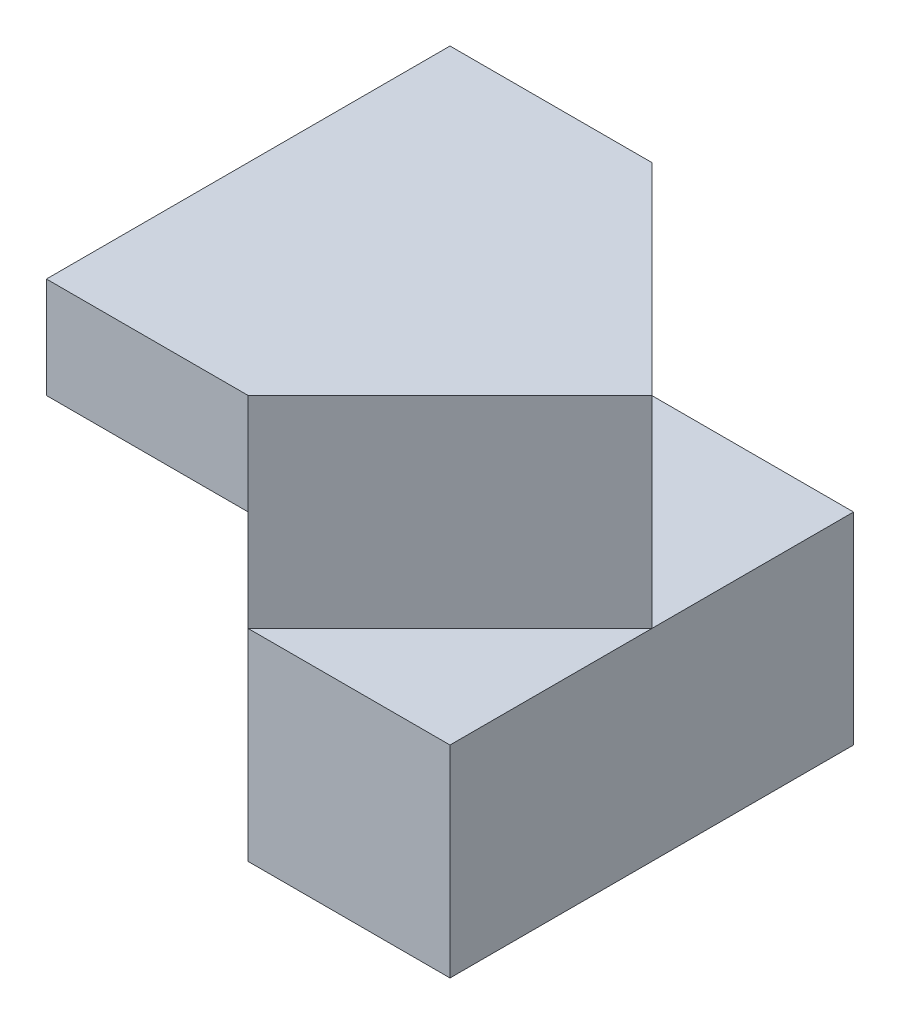
ISO-10303-21;
HEADER;
FILE_DESCRIPTION(('STEP AP214'),'2;1');
FILE_NAME('part.step','',(''),(''),'','','');
FILE_SCHEMA(('AUTOMOTIVE_DESIGN { 1 0 10303 214 1 1 1 1 }'));
ENDSEC;
DATA;
#1=APPLICATION_CONTEXT('core data for automotive mechanical design processes');
#2=APPLICATION_PROTOCOL_DEFINITION('international standard','automotive_design',2000,#1);
#3=PRODUCT_CONTEXT('',#1,'mechanical');
#4=PRODUCT('Part','Part','',(#3));
#5=PRODUCT_RELATED_PRODUCT_CATEGORY('part','',(#4));
#6=PRODUCT_DEFINITION_FORMATION('','',#4);
#7=PRODUCT_DEFINITION_CONTEXT('part definition',#1,'design');
#8=PRODUCT_DEFINITION('design','',#6,#7);
#9=PRODUCT_DEFINITION_SHAPE('','',#8);
#10=(LENGTH_UNIT() NAMED_UNIT(*) SI_UNIT(.MILLI.,.METRE.));
#11=(NAMED_UNIT(*) PLANE_ANGLE_UNIT() SI_UNIT($,.RADIAN.));
#12=(NAMED_UNIT(*) SI_UNIT($,.STERADIAN.) SOLID_ANGLE_UNIT());
#13=UNCERTAINTY_MEASURE_WITH_UNIT(LENGTH_MEASURE(1.E-05),#10,'distance_accuracy_value','');
#14=(GEOMETRIC_REPRESENTATION_CONTEXT(3) GLOBAL_UNCERTAINTY_ASSIGNED_CONTEXT((#13)) GLOBAL_UNIT_ASSIGNED_CONTEXT((#10,
#11,#12)) REPRESENTATION_CONTEXT('',''));
#15=CARTESIAN_POINT('',(0.,0.,0.));
#16=DIRECTION('',(0.,0.,1.));
#17=DIRECTION('',(1.,0.,0.));
#18=AXIS2_PLACEMENT_3D('',#15,#16,#17);
#19=CARTESIAN_POINT('',(0.,0.,0.));
#20=DIRECTION('',(0.,-1.,0.));
#21=DIRECTION('',(0.,0.,-1.));
#22=AXIS2_PLACEMENT_3D('',#19,#20,#21);
#23=PLANE('',#22);
#24=DIRECTION('',(0.,0.,1.));
#25=VECTOR('',#24,1.);
#26=CARTESIAN_POINT('',(2.,0.,-2.));
#27=LINE('',#26,#25);
#28=CARTESIAN_POINT('',(2.,0.,-4.));
#29=VERTEX_POINT('',#28);
#30=CARTESIAN_POINT('',(2.,0.,0.));
#31=VERTEX_POINT('',#30);
#32=EDGE_CURVE('E71',#29,#31,#27,.T.);
#33=ORIENTED_EDGE('',*,*,#32,.F.);
#34=DIRECTION('',(-1.,0.,0.));
#35=VECTOR('',#34,1.);
#36=CARTESIAN_POINT('',(0.,0.,-4.));
#37=LINE('',#36,#35);
#38=CARTESIAN_POINT('',(4.,0.,-4.));
#39=VERTEX_POINT('',#38);
#40=EDGE_CURVE('E125',#39,#29,#37,.T.);
#41=ORIENTED_EDGE('',*,*,#40,.F.);
#42=DIRECTION('',(0.,0.,-1.));
#43=VECTOR('',#42,1.);
#44=CARTESIAN_POINT('',(4.,0.,0.));
#45=LINE('',#44,#43);
#46=CARTESIAN_POINT('',(4.,0.,0.));
#47=VERTEX_POINT('',#46);
#48=EDGE_CURVE('E131',#47,#39,#45,.T.);
#49=ORIENTED_EDGE('',*,*,#48,.F.);
#50=DIRECTION('',(1.,0.,0.));
#51=VECTOR('',#50,1.);
#52=CARTESIAN_POINT('',(0.,0.,0.));
#53=LINE('',#52,#51);
#54=EDGE_CURVE('E129',#31,#47,#53,.T.);
#55=ORIENTED_EDGE('',*,*,#54,.F.);
#56=EDGE_LOOP('',(#33,#41,#49,#55));
#57=FACE_BOUND('',#56,.T.);
#58=ADVANCED_FACE('F33',(#57),#23,.T.);
#59=CARTESIAN_POINT('',(0.,4.,0.));
#60=DIRECTION('',(0.,0.,-1.));
#61=DIRECTION('',(-1.,0.,0.));
#62=AXIS2_PLACEMENT_3D('',#59,#60,#61);
#63=PLANE('',#62);
#64=DIRECTION('',(1.,0.,0.));
#65=VECTOR('',#64,1.);
#66=CARTESIAN_POINT('',(4.,2.,0.));
#67=LINE('',#66,#65);
#68=CARTESIAN_POINT('',(2.,2.,0.));
#69=VERTEX_POINT('',#68);
#70=CARTESIAN_POINT('',(4.,2.,0.));
#71=VERTEX_POINT('',#70);
#72=EDGE_CURVE('E111',#69,#71,#67,.T.);
#73=ORIENTED_EDGE('',*,*,#72,.F.);
#74=DIRECTION('',(0.,1.,0.));
#75=VECTOR('',#74,1.);
#76=CARTESIAN_POINT('',(2.,0.,0.));
#77=LINE('',#76,#75);
#78=EDGE_CURVE('E196',#31,#69,#77,.T.);
#79=ORIENTED_EDGE('',*,*,#78,.F.);
#80=ORIENTED_EDGE('',*,*,#54,.T.);
#81=DIRECTION('',(0.,-1.,0.));
#82=VECTOR('',#81,1.);
#83=CARTESIAN_POINT('',(4.,4.,0.));
#84=LINE('',#83,#82);
#85=EDGE_CURVE('E42',#71,#47,#84,.T.);
#86=ORIENTED_EDGE('',*,*,#85,.F.);
#87=EDGE_LOOP('',(#73,#79,#80,#86));
#88=FACE_BOUND('',#87,.T.);
#89=ADVANCED_FACE('F213',(#88),#63,.F.);
#90=CARTESIAN_POINT('',(0.,4.,0.));
#91=DIRECTION('',(1.,0.,0.));
#92=DIRECTION('',(0.,0.,-1.));
#93=AXIS2_PLACEMENT_3D('',#90,#91,#92);
#94=PLANE('',#93);
#95=DIRECTION('',(0.,-1.,0.));
#96=VECTOR('',#95,1.);
#97=CARTESIAN_POINT('',(0.,4.,-4.));
#98=LINE('',#97,#96);
#99=CARTESIAN_POINT('',(0.,4.,-4.));
#100=VERTEX_POINT('',#99);
#101=CARTESIAN_POINT('',(0.,0.,-4.));
#102=VERTEX_POINT('',#101);
#103=EDGE_CURVE('E123',#100,#102,#98,.T.);
#104=ORIENTED_EDGE('',*,*,#103,.T.);
#105=DIRECTION('',(0.,-0.832050294337844,-0.554700196225229));
#106=VECTOR('',#105,1.);
#107=CARTESIAN_POINT('',(0.,1.84615384615385,-2.76923076923077));
#108=LINE('',#107,#106);
#109=CARTESIAN_POINT('',(0.,3.,-2.));
#110=VERTEX_POINT('',#109);
#111=EDGE_CURVE('E170',#110,#102,#108,.T.);
#112=ORIENTED_EDGE('',*,*,#111,.F.);
#113=DIRECTION('',(0.,0.,-1.));
#114=VECTOR('',#113,1.);
#115=CARTESIAN_POINT('',(0.,3.,0.));
#116=LINE('',#115,#114);
#117=CARTESIAN_POINT('',(0.,3.,0.));
#118=VERTEX_POINT('',#117);
#119=EDGE_CURVE('E194',#118,#110,#116,.T.);
#120=ORIENTED_EDGE('',*,*,#119,.F.);
#121=DIRECTION('',(0.,-1.,0.));
#122=VECTOR('',#121,1.);
#123=CARTESIAN_POINT('',(0.,4.,0.));
#124=LINE('',#123,#122);
#125=CARTESIAN_POINT('',(0.,4.,0.));
#126=VERTEX_POINT('',#125);
#127=EDGE_CURVE('E11',#126,#118,#124,.T.);
#128=ORIENTED_EDGE('',*,*,#127,.F.);
#129=DIRECTION('',(0.,0.,1.));
#130=VECTOR('',#129,1.);
#131=CARTESIAN_POINT('',(0.,4.,0.));
#132=LINE('',#131,#130);
#133=EDGE_CURVE('E120',#100,#126,#132,.T.);
#134=ORIENTED_EDGE('',*,*,#133,.F.);
#135=EDGE_LOOP('',(#104,#112,#120,#128,#134));
#136=FACE_BOUND('',#135,.T.);
#137=ADVANCED_FACE('F35',(#136),#94,.F.);
#138=DIRECTION('',(-1.,0.,0.));
#139=VECTOR('',#138,1.);
#140=CARTESIAN_POINT('',(2.,3.,0.));
#141=LINE('',#140,#139);
#142=CARTESIAN_POINT('',(2.,3.,0.));
#143=VERTEX_POINT('',#142);
#144=EDGE_CURVE('E83',#143,#118,#141,.T.);
#145=ORIENTED_EDGE('',*,*,#144,.F.);
#146=DIRECTION('',(0.,1.,0.));
#147=VECTOR('',#146,1.);
#148=CARTESIAN_POINT('',(2.,2.,0.));
#149=LINE('',#148,#147);
#150=CARTESIAN_POINT('',(2.,4.,0.));
#151=VERTEX_POINT('',#150);
#152=EDGE_CURVE('E107',#143,#151,#149,.T.);
#153=ORIENTED_EDGE('',*,*,#152,.T.);
#154=DIRECTION('',(1.,0.,0.));
#155=VECTOR('',#154,1.);
#156=CARTESIAN_POINT('',(0.,4.,0.));
#157=LINE('',#156,#155);
#158=EDGE_CURVE('E116',#126,#151,#157,.T.);
#159=ORIENTED_EDGE('',*,*,#158,.F.);
#160=ORIENTED_EDGE('',*,*,#127,.T.);
#161=EDGE_LOOP('',(#145,#153,#159,#160));
#162=FACE_BOUND('',#161,.T.);
#163=ADVANCED_FACE('F115',(#162),#63,.F.);
#164=CARTESIAN_POINT('',(4.,4.,0.));
#165=DIRECTION('',(-1.,0.,0.));
#166=DIRECTION('',(0.,0.,1.));
#167=AXIS2_PLACEMENT_3D('',#164,#165,#166);
#168=PLANE('',#167);
#169=DIRECTION('',(0.,-1.,0.));
#170=VECTOR('',#169,1.);
#171=CARTESIAN_POINT('',(4.,4.,-4.));
#172=LINE('',#171,#170);
#173=CARTESIAN_POINT('',(4.,2.,-4.));
#174=VERTEX_POINT('',#173);
#175=EDGE_CURVE('E138',#174,#39,#172,.T.);
#176=ORIENTED_EDGE('',*,*,#175,.F.);
#177=DIRECTION('',(0.,0.,-1.));
#178=VECTOR('',#177,1.);
#179=CARTESIAN_POINT('',(4.,2.,-2.));
#180=LINE('',#179,#178);
#181=CARTESIAN_POINT('',(4.,2.,-2.));
#182=VERTEX_POINT('',#181);
#183=EDGE_CURVE('E182',#182,#174,#180,.T.);
#184=ORIENTED_EDGE('',*,*,#183,.F.);
#185=DIRECTION('',(0.,0.,-1.));
#186=VECTOR('',#185,1.);
#187=CARTESIAN_POINT('',(4.,2.,-2.));
#188=LINE('',#187,#186);
#189=EDGE_CURVE('E189',#71,#182,#188,.T.);
#190=ORIENTED_EDGE('',*,*,#189,.F.);
#191=ORIENTED_EDGE('',*,*,#85,.T.);
#192=ORIENTED_EDGE('',*,*,#48,.T.);
#193=EDGE_LOOP('',(#176,#184,#190,#191,#192));
#194=FACE_BOUND('',#193,.T.);
#195=ADVANCED_FACE('F151',(#194),#168,.F.);
#196=CARTESIAN_POINT('',(0.,4.,-4.));
#197=DIRECTION('',(0.,0.,1.));
#198=DIRECTION('',(1.,0.,0.));
#199=AXIS2_PLACEMENT_3D('',#196,#197,#198);
#200=PLANE('',#199);
#201=DIRECTION('',(-1.,0.,0.));
#202=VECTOR('',#201,1.);
#203=CARTESIAN_POINT('',(0.,4.,-4.));
#204=LINE('',#203,#202);
#205=CARTESIAN_POINT('',(2.,4.,-4.));
#206=VERTEX_POINT('',#205);
#207=EDGE_CURVE('E50',#206,#100,#204,.T.);
#208=ORIENTED_EDGE('',*,*,#207,.F.);
#209=DIRECTION('',(0.,1.,0.));
#210=VECTOR('',#209,1.);
#211=CARTESIAN_POINT('',(2.,2.,-4.));
#212=LINE('',#211,#210);
#213=CARTESIAN_POINT('',(2.,2.,-4.));
#214=VERTEX_POINT('',#213);
#215=EDGE_CURVE('E112',#214,#206,#212,.T.);
#216=ORIENTED_EDGE('',*,*,#215,.F.);
#217=DIRECTION('',(-1.,0.,0.));
#218=VECTOR('',#217,1.);
#219=CARTESIAN_POINT('',(4.,2.,-4.));
#220=LINE('',#219,#218);
#221=EDGE_CURVE('E148',#174,#214,#220,.T.);
#222=ORIENTED_EDGE('',*,*,#221,.F.);
#223=ORIENTED_EDGE('',*,*,#175,.T.);
#224=ORIENTED_EDGE('',*,*,#40,.T.);
#225=DIRECTION('',(-1.,0.,0.));
#226=VECTOR('',#225,1.);
#227=CARTESIAN_POINT('',(2.,0.,-4.));
#228=LINE('',#227,#226);
#229=EDGE_CURVE('E163',#29,#102,#228,.T.);
#230=ORIENTED_EDGE('',*,*,#229,.T.);
#231=ORIENTED_EDGE('',*,*,#103,.F.);
#232=EDGE_LOOP('',(#208,#216,#222,#223,#224,#230,#231));
#233=FACE_BOUND('',#232,.T.);
#234=ADVANCED_FACE('F142',(#233),#200,.F.);
#235=CARTESIAN_POINT('',(0.,4.,0.));
#236=DIRECTION('',(0.,-1.,0.));
#237=DIRECTION('',(0.,0.,-1.));
#238=AXIS2_PLACEMENT_3D('',#235,#236,#237);
#239=PLANE('',#238);
#240=DIRECTION('',(-0.707106781186548,0.,0.707106781186548));
#241=VECTOR('',#240,1.);
#242=CARTESIAN_POINT('',(2.,4.,0.));
#243=LINE('',#242,#241);
#244=CARTESIAN_POINT('',(4.,4.,-2.));
#245=VERTEX_POINT('',#244);
#246=EDGE_CURVE('E104',#245,#151,#243,.T.);
#247=ORIENTED_EDGE('',*,*,#246,.F.);
#248=DIRECTION('',(0.707106781186548,0.,0.707106781186548));
#249=VECTOR('',#248,1.);
#250=CARTESIAN_POINT('',(2.,4.,-4.));
#251=LINE('',#250,#249);
#252=EDGE_CURVE('E171',#206,#245,#251,.T.);
#253=ORIENTED_EDGE('',*,*,#252,.F.);
#254=ORIENTED_EDGE('',*,*,#207,.T.);
#255=ORIENTED_EDGE('',*,*,#133,.T.);
#256=ORIENTED_EDGE('',*,*,#158,.T.);
#257=EDGE_LOOP('',(#247,#253,#254,#255,#256));
#258=FACE_BOUND('',#257,.T.);
#259=ADVANCED_FACE('F118',(#258),#239,.F.);
#260=CARTESIAN_POINT('',(2.,3.,0.));
#261=DIRECTION('',(0.,1.,0.));
#262=DIRECTION('',(0.,0.,1.));
#263=AXIS2_PLACEMENT_3D('',#260,#261,#262);
#264=PLANE('',#263);
#265=ORIENTED_EDGE('',*,*,#119,.T.);
#266=DIRECTION('',(-1.,0.,0.));
#267=VECTOR('',#266,1.);
#268=CARTESIAN_POINT('',(2.,3.,-2.));
#269=LINE('',#268,#267);
#270=CARTESIAN_POINT('',(2.,3.,-2.));
#271=VERTEX_POINT('',#270);
#272=EDGE_CURVE('E132',#271,#110,#269,.T.);
#273=ORIENTED_EDGE('',*,*,#272,.F.);
#274=DIRECTION('',(0.,0.,-1.));
#275=VECTOR('',#274,1.);
#276=CARTESIAN_POINT('',(2.,3.,0.));
#277=LINE('',#276,#275);
#278=EDGE_CURVE('E158',#143,#271,#277,.T.);
#279=ORIENTED_EDGE('',*,*,#278,.F.);
#280=ORIENTED_EDGE('',*,*,#144,.T.);
#281=EDGE_LOOP('',(#265,#273,#279,#280));
#282=FACE_BOUND('',#281,.T.);
#283=ADVANCED_FACE('F203',(#282),#264,.F.);
#284=CARTESIAN_POINT('',(2.,0.,0.));
#285=DIRECTION('',(-1.,0.,0.));
#286=DIRECTION('',(0.,0.,1.));
#287=AXIS2_PLACEMENT_3D('',#284,#285,#286);
#288=PLANE('',#287);
#289=ORIENTED_EDGE('',*,*,#78,.T.);
#290=EDGE_CURVE('E91',#69,#143,#149,.T.);
#291=ORIENTED_EDGE('',*,*,#290,.T.);
#292=ORIENTED_EDGE('',*,*,#278,.T.);
#293=DIRECTION('',(0.,-0.832050294337844,-0.554700196225229));
#294=VECTOR('',#293,1.);
#295=CARTESIAN_POINT('',(2.,1.84615384615385,-2.76923076923077));
#296=LINE('',#295,#294);
#297=EDGE_CURVE('E166',#271,#29,#296,.T.);
#298=ORIENTED_EDGE('',*,*,#297,.T.);
#299=ORIENTED_EDGE('',*,*,#32,.T.);
#300=EDGE_LOOP('',(#289,#291,#292,#298,#299));
#301=FACE_BOUND('',#300,.T.);
#302=ADVANCED_FACE('F174',(#301),#288,.T.);
#303=CARTESIAN_POINT('',(2.,2.,0.));
#304=DIRECTION('',(-0.707106781186547,0.,-0.707106781186547));
#305=DIRECTION('',(-0.707106781186548,0.,0.707106781186548));
#306=AXIS2_PLACEMENT_3D('',#303,#304,#305);
#307=PLANE('',#306);
#308=ORIENTED_EDGE('',*,*,#246,.T.);
#309=ORIENTED_EDGE('',*,*,#152,.F.);
#310=ORIENTED_EDGE('',*,*,#290,.F.);
#311=DIRECTION('',(-0.707106781186548,0.,0.707106781186548));
#312=VECTOR('',#311,1.);
#313=CARTESIAN_POINT('',(2.,2.,0.));
#314=LINE('',#313,#312);
#315=EDGE_CURVE('E192',#182,#69,#314,.T.);
#316=ORIENTED_EDGE('',*,*,#315,.F.);
#317=DIRECTION('',(0.,1.,0.));
#318=VECTOR('',#317,1.);
#319=CARTESIAN_POINT('',(4.,2.,-2.));
#320=LINE('',#319,#318);
#321=EDGE_CURVE('E109',#182,#245,#320,.T.);
#322=ORIENTED_EDGE('',*,*,#321,.T.);
#323=EDGE_LOOP('',(#308,#309,#310,#316,#322));
#324=FACE_BOUND('',#323,.T.);
#325=ADVANCED_FACE('F106',(#324),#307,.F.);
#326=CARTESIAN_POINT('',(0.,2.,0.));
#327=DIRECTION('',(0.,1.,0.));
#328=DIRECTION('',(0.,0.,1.));
#329=AXIS2_PLACEMENT_3D('',#326,#327,#328);
#330=PLANE('',#329);
#331=ORIENTED_EDGE('',*,*,#72,.T.);
#332=ORIENTED_EDGE('',*,*,#189,.T.);
#333=ORIENTED_EDGE('',*,*,#315,.T.);
#334=EDGE_LOOP('',(#331,#332,#333));
#335=FACE_BOUND('',#334,.T.);
#336=ADVANCED_FACE('F262',(#335),#330,.T.);
#337=CARTESIAN_POINT('',(2.,2.,-4.));
#338=DIRECTION('',(-0.707106781186547,0.,0.707106781186547));
#339=DIRECTION('',(0.707106781186548,0.,0.707106781186548));
#340=AXIS2_PLACEMENT_3D('',#337,#338,#339);
#341=PLANE('',#340);
#342=ORIENTED_EDGE('',*,*,#252,.T.);
#343=ORIENTED_EDGE('',*,*,#321,.F.);
#344=DIRECTION('',(0.707106781186548,0.,0.707106781186548));
#345=VECTOR('',#344,1.);
#346=CARTESIAN_POINT('',(2.,2.,-4.));
#347=LINE('',#346,#345);
#348=EDGE_CURVE('E179',#214,#182,#347,.T.);
#349=ORIENTED_EDGE('',*,*,#348,.F.);
#350=ORIENTED_EDGE('',*,*,#215,.T.);
#351=EDGE_LOOP('',(#342,#343,#349,#350));
#352=FACE_BOUND('',#351,.T.);
#353=ADVANCED_FACE('F271',(#352),#341,.F.);
#354=CARTESIAN_POINT('',(0.,2.,0.));
#355=DIRECTION('',(0.,-1.,0.));
#356=DIRECTION('',(0.,0.,-1.));
#357=AXIS2_PLACEMENT_3D('',#354,#355,#356);
#358=PLANE('',#357);
#359=ORIENTED_EDGE('',*,*,#221,.T.);
#360=ORIENTED_EDGE('',*,*,#348,.T.);
#361=ORIENTED_EDGE('',*,*,#183,.T.);
#362=EDGE_LOOP('',(#359,#360,#361));
#363=FACE_BOUND('',#362,.T.);
#364=ADVANCED_FACE('F281',(#363),#358,.F.);
#365=CARTESIAN_POINT('',(2.,1.84615384615385,-2.76923076923077));
#366=DIRECTION('',(0.,0.554700196225229,-0.832050294337844));
#367=DIRECTION('',(0.,0.832050294337844,0.554700196225229));
#368=AXIS2_PLACEMENT_3D('',#365,#366,#367);
#369=PLANE('',#368);
#370=ORIENTED_EDGE('',*,*,#111,.T.);
#371=ORIENTED_EDGE('',*,*,#229,.F.);
#372=ORIENTED_EDGE('',*,*,#297,.F.);
#373=ORIENTED_EDGE('',*,*,#272,.T.);
#374=EDGE_LOOP('',(#370,#371,#372,#373));
#375=FACE_BOUND('',#374,.T.);
#376=ADVANCED_FACE('F164',(#375),#369,.F.);
#377=CLOSED_SHELL('',(#58,#89,#137,#163,#195,#234,#259,#283,#302,#325,#336,#353,#364,#376));
#378=MANIFOLD_SOLID_BREP('B2',#377);
#379=ADVANCED_BREP_SHAPE_REPRESENTATION('',(#18,#378),#14);
#380=SHAPE_DEFINITION_REPRESENTATION(#9,#379);
ENDSEC;
END-ISO-10303-21;
